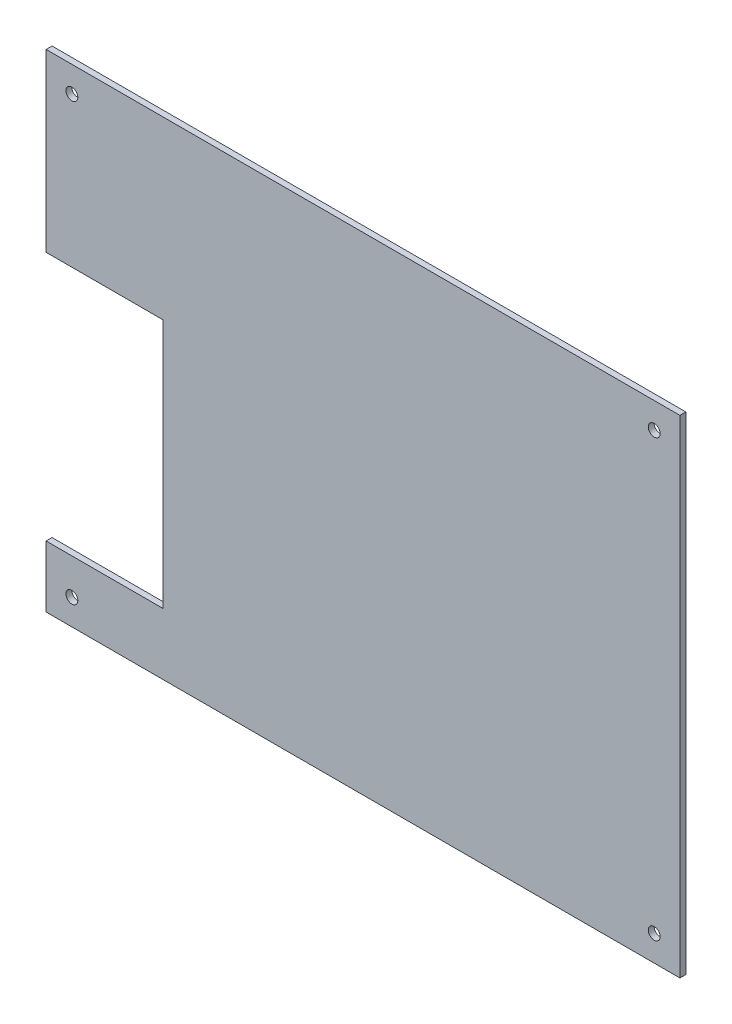
ISO-10303-21;
HEADER;
FILE_DESCRIPTION(('STEP AP214'),'2;1');
FILE_NAME('part.step','',(''),(''),'','','');
FILE_SCHEMA(('AUTOMOTIVE_DESIGN { 1 0 10303 214 1 1 1 1 }'));
ENDSEC;
DATA;
#1=APPLICATION_CONTEXT('core data for automotive mechanical design processes');
#2=APPLICATION_PROTOCOL_DEFINITION('international standard','automotive_design',2000,#1);
#3=PRODUCT_CONTEXT('',#1,'mechanical');
#4=PRODUCT('Part','Part','',(#3));
#5=PRODUCT_RELATED_PRODUCT_CATEGORY('part','',(#4));
#6=PRODUCT_DEFINITION_FORMATION('','',#4);
#7=PRODUCT_DEFINITION_CONTEXT('part definition',#1,'design');
#8=PRODUCT_DEFINITION('design','',#6,#7);
#9=PRODUCT_DEFINITION_SHAPE('','',#8);
#10=(LENGTH_UNIT() NAMED_UNIT(*) SI_UNIT(.MILLI.,.METRE.));
#11=(NAMED_UNIT(*) PLANE_ANGLE_UNIT() SI_UNIT($,.RADIAN.));
#12=(NAMED_UNIT(*) SI_UNIT($,.STERADIAN.) SOLID_ANGLE_UNIT());
#13=UNCERTAINTY_MEASURE_WITH_UNIT(LENGTH_MEASURE(1.E-05),#10,'distance_accuracy_value','');
#14=(GEOMETRIC_REPRESENTATION_CONTEXT(3) GLOBAL_UNCERTAINTY_ASSIGNED_CONTEXT((#13)) GLOBAL_UNIT_ASSIGNED_CONTEXT((#10,
#11,#12)) REPRESENTATION_CONTEXT('',''));
#15=CARTESIAN_POINT('',(0.,0.,0.));
#16=DIRECTION('',(0.,0.,1.));
#17=DIRECTION('',(1.,0.,0.));
#18=AXIS2_PLACEMENT_3D('',#15,#16,#17);
#19=CARTESIAN_POINT('',(1037.34751782577,-1519.02260067621,2.25));
#20=DIRECTION('',(0.,0.,1.));
#21=DIRECTION('',(1.,0.,0.));
#22=AXIS2_PLACEMENT_3D('',#19,#20,#21);
#23=PLANE('',#22);
#24=CARTESIAN_POINT('',(1079.10835313975,-1742.80288964024,2.25));
#25=DIRECTION('',(0.,0.,1.));
#26=DIRECTION('',(1.,0.,0.));
#27=AXIS2_PLACEMENT_3D('',#24,#25,#26);
#28=CIRCLE('',#27,1.49999999999995);
#29=CARTESIAN_POINT('',(1080.60835313975,-1742.80288964024,2.25));
#30=VERTEX_POINT('',#29);
#31=EDGE_CURVE('E120',#30,#30,#28,.T.);
#32=ORIENTED_EDGE('',*,*,#31,.F.);
#33=EDGE_LOOP('',(#32));
#34=FACE_BOUND('',#33,.T.);
#35=CARTESIAN_POINT('',(1079.10835313975,-1632.80288964024,2.25));
#36=DIRECTION('',(0.,0.,1.));
#37=DIRECTION('',(1.,0.,0.));
#38=AXIS2_PLACEMENT_3D('',#35,#36,#37);
#39=CIRCLE('',#38,1.49999999999995);
#40=CARTESIAN_POINT('',(1080.60835313975,-1632.80288964024,2.25));
#41=VERTEX_POINT('',#40);
#42=EDGE_CURVE('E115',#41,#41,#39,.T.);
#43=ORIENTED_EDGE('',*,*,#42,.F.);
#44=EDGE_LOOP('',(#43));
#45=FACE_BOUND('',#44,.T.);
#46=CARTESIAN_POINT('',(1226.10835313975,-1742.80288964024,2.25));
#47=DIRECTION('',(0.,0.,1.));
#48=DIRECTION('',(1.,0.,0.));
#49=AXIS2_PLACEMENT_3D('',#46,#47,#48);
#50=CIRCLE('',#49,1.49999999999995);
#51=CARTESIAN_POINT('',(1227.60835313975,-1742.80288964024,2.25));
#52=VERTEX_POINT('',#51);
#53=EDGE_CURVE('E116',#52,#52,#50,.T.);
#54=ORIENTED_EDGE('',*,*,#53,.F.);
#55=EDGE_LOOP('',(#54));
#56=FACE_BOUND('',#55,.T.);
#57=CARTESIAN_POINT('',(1226.10835313975,-1632.80288964024,2.25));
#58=DIRECTION('',(0.,0.,1.));
#59=DIRECTION('',(1.,0.,0.));
#60=AXIS2_PLACEMENT_3D('',#57,#58,#59);
#61=CIRCLE('',#60,1.49999999999995);
#62=CARTESIAN_POINT('',(1227.60835313975,-1632.80288964024,2.25));
#63=VERTEX_POINT('',#62);
#64=EDGE_CURVE('E124',#63,#63,#61,.T.);
#65=ORIENTED_EDGE('',*,*,#64,.F.);
#66=EDGE_LOOP('',(#65));
#67=FACE_BOUND('',#66,.T.);
#68=DIRECTION('',(0.,-1.,0.));
#69=VECTOR('',#68,1.);
#70=CARTESIAN_POINT('',(1072.60835313975,-1626.30288964024,2.25));
#71=LINE('',#70,#69);
#72=CARTESIAN_POINT('',(1072.60835313975,-1626.30288964024,2.25));
#73=VERTEX_POINT('',#72);
#74=CARTESIAN_POINT('',(1072.60835313975,-1670.66288964024,2.25));
#75=VERTEX_POINT('',#74);
#76=EDGE_CURVE('E151',#73,#75,#71,.T.);
#77=ORIENTED_EDGE('',*,*,#76,.T.);
#78=DIRECTION('',(1.,0.,0.));
#79=VECTOR('',#78,1.);
#80=CARTESIAN_POINT('',(1072.60835313975,-1670.66288964024,2.25));
#81=LINE('',#80,#79);
#82=CARTESIAN_POINT('',(1102.10835313975,-1670.66288964024,2.25));
#83=VERTEX_POINT('',#82);
#84=EDGE_CURVE('E173',#75,#83,#81,.T.);
#85=ORIENTED_EDGE('',*,*,#84,.T.);
#86=DIRECTION('',(0.,-1.,0.));
#87=VECTOR('',#86,1.);
#88=CARTESIAN_POINT('',(1102.10835313975,-1670.66288964024,2.25));
#89=LINE('',#88,#87);
#90=CARTESIAN_POINT('',(1102.10835313975,-1733.76288964024,2.25));
#91=VERTEX_POINT('',#90);
#92=EDGE_CURVE('E201',#83,#91,#89,.T.);
#93=ORIENTED_EDGE('',*,*,#92,.T.);
#94=DIRECTION('',(1.,0.,0.));
#95=VECTOR('',#94,1.);
#96=CARTESIAN_POINT('',(1072.60835313975,-1733.76288964024,2.25));
#97=LINE('',#96,#95);
#98=CARTESIAN_POINT('',(1072.60835313975,-1733.76288964024,2.25));
#99=VERTEX_POINT('',#98);
#100=EDGE_CURVE('E187',#99,#91,#97,.T.);
#101=ORIENTED_EDGE('',*,*,#100,.F.);
#102=CARTESIAN_POINT('',(1072.60835313975,-1749.30288964024,2.25));
#103=VERTEX_POINT('',#102);
#104=EDGE_CURVE('E108',#99,#103,#71,.T.);
#105=ORIENTED_EDGE('',*,*,#104,.T.);
#106=DIRECTION('',(1.,0.,0.));
#107=VECTOR('',#106,1.);
#108=CARTESIAN_POINT('',(1072.60835313975,-1749.30288964024,2.25));
#109=LINE('',#108,#107);
#110=CARTESIAN_POINT('',(1232.60835313975,-1749.30288964024,2.25));
#111=VERTEX_POINT('',#110);
#112=EDGE_CURVE('E153',#103,#111,#109,.T.);
#113=ORIENTED_EDGE('',*,*,#112,.T.);
#114=DIRECTION('',(0.,1.,0.));
#115=VECTOR('',#114,1.);
#116=CARTESIAN_POINT('',(1232.60835313975,-1626.30288964024,2.25));
#117=LINE('',#116,#115);
#118=CARTESIAN_POINT('',(1232.60835313975,-1626.30288964024,2.25));
#119=VERTEX_POINT('',#118);
#120=EDGE_CURVE('E101',#111,#119,#117,.T.);
#121=ORIENTED_EDGE('',*,*,#120,.T.);
#122=DIRECTION('',(-1.,0.,0.));
#123=VECTOR('',#122,1.);
#124=CARTESIAN_POINT('',(1072.60835313975,-1626.30288964024,2.25));
#125=LINE('',#124,#123);
#126=EDGE_CURVE('E64',#119,#73,#125,.T.);
#127=ORIENTED_EDGE('',*,*,#126,.T.);
#128=EDGE_LOOP('',(#77,#85,#93,#101,#105,#113,#121,#127));
#129=FACE_BOUND('',#128,.T.);
#130=ADVANCED_FACE('F38',(#34,#45,#56,#67,#129),#23,.T.);
#131=CARTESIAN_POINT('',(1037.34751782577,-1519.02260067621,0.75));
#132=DIRECTION('',(0.,0.,1.));
#133=DIRECTION('',(1.,0.,0.));
#134=AXIS2_PLACEMENT_3D('',#131,#132,#133);
#135=PLANE('',#134);
#136=CARTESIAN_POINT('',(1226.10835313975,-1632.80288964024,0.75));
#137=DIRECTION('',(0.,0.,1.));
#138=DIRECTION('',(1.,0.,0.));
#139=AXIS2_PLACEMENT_3D('',#136,#137,#138);
#140=CIRCLE('',#139,1.49999999999995);
#141=CARTESIAN_POINT('',(1227.60835313975,-1632.80288964024,0.75));
#142=VERTEX_POINT('',#141);
#143=EDGE_CURVE('E125',#142,#142,#140,.T.);
#144=ORIENTED_EDGE('',*,*,#143,.T.);
#145=EDGE_LOOP('',(#144));
#146=FACE_BOUND('',#145,.T.);
#147=CARTESIAN_POINT('',(1079.10835313975,-1742.80288964024,0.75));
#148=DIRECTION('',(0.,0.,1.));
#149=DIRECTION('',(1.,0.,0.));
#150=AXIS2_PLACEMENT_3D('',#147,#148,#149);
#151=CIRCLE('',#150,1.49999999999995);
#152=CARTESIAN_POINT('',(1080.60835313975,-1742.80288964024,0.75));
#153=VERTEX_POINT('',#152);
#154=EDGE_CURVE('E121',#153,#153,#151,.T.);
#155=ORIENTED_EDGE('',*,*,#154,.T.);
#156=EDGE_LOOP('',(#155));
#157=FACE_BOUND('',#156,.T.);
#158=CARTESIAN_POINT('',(1226.10835313975,-1742.80288964024,0.75));
#159=DIRECTION('',(0.,0.,1.));
#160=DIRECTION('',(1.,0.,0.));
#161=AXIS2_PLACEMENT_3D('',#158,#159,#160);
#162=CIRCLE('',#161,1.49999999999995);
#163=CARTESIAN_POINT('',(1227.60835313975,-1742.80288964024,0.75));
#164=VERTEX_POINT('',#163);
#165=EDGE_CURVE('E117',#164,#164,#162,.T.);
#166=ORIENTED_EDGE('',*,*,#165,.T.);
#167=EDGE_LOOP('',(#166));
#168=FACE_BOUND('',#167,.T.);
#169=CARTESIAN_POINT('',(1079.10835313975,-1632.80288964024,0.75));
#170=DIRECTION('',(0.,0.,1.));
#171=DIRECTION('',(1.,0.,0.));
#172=AXIS2_PLACEMENT_3D('',#169,#170,#171);
#173=CIRCLE('',#172,1.49999999999995);
#174=CARTESIAN_POINT('',(1080.60835313975,-1632.80288964024,0.75));
#175=VERTEX_POINT('',#174);
#176=EDGE_CURVE('E112',#175,#175,#173,.T.);
#177=ORIENTED_EDGE('',*,*,#176,.T.);
#178=EDGE_LOOP('',(#177));
#179=FACE_BOUND('',#178,.T.);
#180=DIRECTION('',(1.,0.,0.));
#181=VECTOR('',#180,1.);
#182=CARTESIAN_POINT('',(1072.60835313975,-1670.66288964024,0.75));
#183=LINE('',#182,#181);
#184=CARTESIAN_POINT('',(1072.60835313975,-1670.66288964024,0.75));
#185=VERTEX_POINT('',#184);
#186=CARTESIAN_POINT('',(1102.10835313975,-1670.66288964024,0.75));
#187=VERTEX_POINT('',#186);
#188=EDGE_CURVE('E196',#185,#187,#183,.T.);
#189=ORIENTED_EDGE('',*,*,#188,.F.);
#190=DIRECTION('',(0.,-1.,0.));
#191=VECTOR('',#190,1.);
#192=CARTESIAN_POINT('',(1072.60835313975,-1626.30288964024,0.75));
#193=LINE('',#192,#191);
#194=CARTESIAN_POINT('',(1072.60835313975,-1626.30288964024,0.75));
#195=VERTEX_POINT('',#194);
#196=EDGE_CURVE('E95',#195,#185,#193,.T.);
#197=ORIENTED_EDGE('',*,*,#196,.F.);
#198=DIRECTION('',(-1.,0.,0.));
#199=VECTOR('',#198,1.);
#200=CARTESIAN_POINT('',(1072.60835313975,-1626.30288964024,0.75));
#201=LINE('',#200,#199);
#202=CARTESIAN_POINT('',(1232.60835313975,-1626.30288964024,0.75));
#203=VERTEX_POINT('',#202);
#204=EDGE_CURVE('E106',#203,#195,#201,.T.);
#205=ORIENTED_EDGE('',*,*,#204,.F.);
#206=DIRECTION('',(0.,1.,0.));
#207=VECTOR('',#206,1.);
#208=CARTESIAN_POINT('',(1232.60835313975,-1626.30288964024,0.75));
#209=LINE('',#208,#207);
#210=CARTESIAN_POINT('',(1232.60835313975,-1749.30288964024,0.75));
#211=VERTEX_POINT('',#210);
#212=EDGE_CURVE('E94',#211,#203,#209,.T.);
#213=ORIENTED_EDGE('',*,*,#212,.F.);
#214=DIRECTION('',(1.,0.,0.));
#215=VECTOR('',#214,1.);
#216=CARTESIAN_POINT('',(1072.60835313975,-1749.30288964024,0.75));
#217=LINE('',#216,#215);
#218=CARTESIAN_POINT('',(1072.60835313975,-1749.30288964024,0.75));
#219=VERTEX_POINT('',#218);
#220=EDGE_CURVE('E85',#219,#211,#217,.T.);
#221=ORIENTED_EDGE('',*,*,#220,.F.);
#222=CARTESIAN_POINT('',(1072.60835313975,-1733.76288964024,0.75));
#223=VERTEX_POINT('',#222);
#224=EDGE_CURVE('E150',#223,#219,#193,.T.);
#225=ORIENTED_EDGE('',*,*,#224,.F.);
#226=DIRECTION('',(1.,0.,0.));
#227=VECTOR('',#226,1.);
#228=CARTESIAN_POINT('',(1072.60835313975,-1733.76288964024,0.75));
#229=LINE('',#228,#227);
#230=CARTESIAN_POINT('',(1102.10835313975,-1733.76288964024,0.75));
#231=VERTEX_POINT('',#230);
#232=EDGE_CURVE('E55',#223,#231,#229,.T.);
#233=ORIENTED_EDGE('',*,*,#232,.T.);
#234=DIRECTION('',(0.,-1.,0.));
#235=VECTOR('',#234,1.);
#236=CARTESIAN_POINT('',(1102.10835313975,-1670.66288964024,0.75));
#237=LINE('',#236,#235);
#238=EDGE_CURVE('E192',#187,#231,#237,.T.);
#239=ORIENTED_EDGE('',*,*,#238,.F.);
#240=EDGE_LOOP('',(#189,#197,#205,#213,#221,#225,#233,#239));
#241=FACE_BOUND('',#240,.T.);
#242=ADVANCED_FACE('F104',(#146,#157,#168,#179,#241),#135,.F.);
#243=CARTESIAN_POINT('',(1072.60835313975,-1626.30288964024,2.25));
#244=DIRECTION('',(1.,0.,0.));
#245=DIRECTION('',(0.,1.,0.));
#246=AXIS2_PLACEMENT_3D('',#243,#244,#245);
#247=PLANE('',#246);
#248=DIRECTION('',(0.,0.,1.));
#249=VECTOR('',#248,1.);
#250=CARTESIAN_POINT('',(1072.60835313975,-1670.66288964024,0.75));
#251=LINE('',#250,#249);
#252=EDGE_CURVE('E171',#185,#75,#251,.T.);
#253=ORIENTED_EDGE('',*,*,#252,.T.);
#254=ORIENTED_EDGE('',*,*,#76,.F.);
#255=DIRECTION('',(0.,0.,-1.));
#256=VECTOR('',#255,1.);
#257=CARTESIAN_POINT('',(1072.60835313975,-1626.30288964024,2.25));
#258=LINE('',#257,#256);
#259=EDGE_CURVE('E158',#73,#195,#258,.T.);
#260=ORIENTED_EDGE('',*,*,#259,.T.);
#261=ORIENTED_EDGE('',*,*,#196,.T.);
#262=EDGE_LOOP('',(#253,#254,#260,#261));
#263=FACE_BOUND('',#262,.T.);
#264=ADVANCED_FACE('F168',(#263),#247,.F.);
#265=ORIENTED_EDGE('',*,*,#104,.F.);
#266=DIRECTION('',(0.,0.,1.));
#267=VECTOR('',#266,1.);
#268=CARTESIAN_POINT('',(1072.60835313975,-1733.76288964024,0.75));
#269=LINE('',#268,#267);
#270=EDGE_CURVE('E142',#223,#99,#269,.T.);
#271=ORIENTED_EDGE('',*,*,#270,.F.);
#272=ORIENTED_EDGE('',*,*,#224,.T.);
#273=DIRECTION('',(0.,0.,-1.));
#274=VECTOR('',#273,1.);
#275=CARTESIAN_POINT('',(1072.60835313975,-1749.30288964024,2.25));
#276=LINE('',#275,#274);
#277=EDGE_CURVE('E11',#103,#219,#276,.T.);
#278=ORIENTED_EDGE('',*,*,#277,.F.);
#279=EDGE_LOOP('',(#265,#271,#272,#278));
#280=FACE_BOUND('',#279,.T.);
#281=ADVANCED_FACE('F189',(#280),#247,.F.);
#282=CARTESIAN_POINT('',(1072.60835313975,-1749.30288964024,2.25));
#283=DIRECTION('',(0.,1.,0.));
#284=DIRECTION('',(0.,0.,1.));
#285=AXIS2_PLACEMENT_3D('',#282,#283,#284);
#286=PLANE('',#285);
#287=ORIENTED_EDGE('',*,*,#220,.T.);
#288=DIRECTION('',(0.,0.,-1.));
#289=VECTOR('',#288,1.);
#290=CARTESIAN_POINT('',(1232.60835313975,-1749.30288964024,2.25));
#291=LINE('',#290,#289);
#292=EDGE_CURVE('E47',#111,#211,#291,.T.);
#293=ORIENTED_EDGE('',*,*,#292,.F.);
#294=ORIENTED_EDGE('',*,*,#112,.F.);
#295=ORIENTED_EDGE('',*,*,#277,.T.);
#296=EDGE_LOOP('',(#287,#293,#294,#295));
#297=FACE_BOUND('',#296,.T.);
#298=ADVANCED_FACE('F87',(#297),#286,.F.);
#299=CARTESIAN_POINT('',(1232.60835313975,-1626.30288964024,2.25));
#300=DIRECTION('',(-1.,0.,0.));
#301=DIRECTION('',(0.,0.,1.));
#302=AXIS2_PLACEMENT_3D('',#299,#300,#301);
#303=PLANE('',#302);
#304=ORIENTED_EDGE('',*,*,#212,.T.);
#305=DIRECTION('',(0.,0.,-1.));
#306=VECTOR('',#305,1.);
#307=CARTESIAN_POINT('',(1232.60835313975,-1626.30288964024,2.25));
#308=LINE('',#307,#306);
#309=EDGE_CURVE('E42',#119,#203,#308,.T.);
#310=ORIENTED_EDGE('',*,*,#309,.F.);
#311=ORIENTED_EDGE('',*,*,#120,.F.);
#312=ORIENTED_EDGE('',*,*,#292,.T.);
#313=EDGE_LOOP('',(#304,#310,#311,#312));
#314=FACE_BOUND('',#313,.T.);
#315=ADVANCED_FACE('F98',(#314),#303,.F.);
#316=CARTESIAN_POINT('',(1072.60835313975,-1626.30288964024,2.25));
#317=DIRECTION('',(0.,-1.,0.));
#318=DIRECTION('',(0.,0.,-1.));
#319=AXIS2_PLACEMENT_3D('',#316,#317,#318);
#320=PLANE('',#319);
#321=ORIENTED_EDGE('',*,*,#204,.T.);
#322=ORIENTED_EDGE('',*,*,#259,.F.);
#323=ORIENTED_EDGE('',*,*,#126,.F.);
#324=ORIENTED_EDGE('',*,*,#309,.T.);
#325=EDGE_LOOP('',(#321,#322,#323,#324));
#326=FACE_BOUND('',#325,.T.);
#327=ADVANCED_FACE('F166',(#326),#320,.F.);
#328=CARTESIAN_POINT('',(1079.10835313975,-1632.80288964024,2.25));
#329=DIRECTION('',(0.,0.,-1.));
#330=DIRECTION('',(-1.,0.,0.));
#331=AXIS2_PLACEMENT_3D('',#328,#329,#330);
#332=CYLINDRICAL_SURFACE('',#331,1.49999999999995);
#333=ORIENTED_EDGE('',*,*,#42,.T.);
#334=EDGE_LOOP('',(#333));
#335=FACE_BOUND('',#334,.T.);
#336=ORIENTED_EDGE('',*,*,#176,.F.);
#337=EDGE_LOOP('',(#336));
#338=FACE_BOUND('',#337,.T.);
#339=ADVANCED_FACE('F237',(#335,#338),#332,.F.);
#340=CARTESIAN_POINT('',(1226.10835313975,-1742.80288964024,2.25));
#341=DIRECTION('',(0.,0.,-1.));
#342=DIRECTION('',(-1.,0.,0.));
#343=AXIS2_PLACEMENT_3D('',#340,#341,#342);
#344=CYLINDRICAL_SURFACE('',#343,1.49999999999995);
#345=ORIENTED_EDGE('',*,*,#53,.T.);
#346=EDGE_LOOP('',(#345));
#347=FACE_BOUND('',#346,.T.);
#348=ORIENTED_EDGE('',*,*,#165,.F.);
#349=EDGE_LOOP('',(#348));
#350=FACE_BOUND('',#349,.T.);
#351=ADVANCED_FACE('F240',(#347,#350),#344,.F.);
#352=CARTESIAN_POINT('',(1079.10835313975,-1742.80288964024,2.25));
#353=DIRECTION('',(0.,0.,-1.));
#354=DIRECTION('',(-1.,0.,0.));
#355=AXIS2_PLACEMENT_3D('',#352,#353,#354);
#356=CYLINDRICAL_SURFACE('',#355,1.49999999999995);
#357=ORIENTED_EDGE('',*,*,#31,.T.);
#358=EDGE_LOOP('',(#357));
#359=FACE_BOUND('',#358,.T.);
#360=ORIENTED_EDGE('',*,*,#154,.F.);
#361=EDGE_LOOP('',(#360));
#362=FACE_BOUND('',#361,.T.);
#363=ADVANCED_FACE('F217',(#359,#362),#356,.F.);
#364=CARTESIAN_POINT('',(1226.10835313975,-1632.80288964024,2.25));
#365=DIRECTION('',(0.,0.,-1.));
#366=DIRECTION('',(-1.,0.,0.));
#367=AXIS2_PLACEMENT_3D('',#364,#365,#366);
#368=CYLINDRICAL_SURFACE('',#367,1.49999999999995);
#369=ORIENTED_EDGE('',*,*,#64,.T.);
#370=EDGE_LOOP('',(#369));
#371=FACE_BOUND('',#370,.T.);
#372=ORIENTED_EDGE('',*,*,#143,.F.);
#373=EDGE_LOOP('',(#372));
#374=FACE_BOUND('',#373,.T.);
#375=ADVANCED_FACE('F40',(#371,#374),#368,.F.);
#376=CARTESIAN_POINT('',(1072.60835313975,-1670.66288964024,0.75));
#377=DIRECTION('',(0.,-1.,0.));
#378=DIRECTION('',(0.,0.,-1.));
#379=AXIS2_PLACEMENT_3D('',#376,#377,#378);
#380=PLANE('',#379);
#381=ORIENTED_EDGE('',*,*,#84,.F.);
#382=ORIENTED_EDGE('',*,*,#252,.F.);
#383=ORIENTED_EDGE('',*,*,#188,.T.);
#384=DIRECTION('',(0.,0.,1.));
#385=VECTOR('',#384,1.);
#386=CARTESIAN_POINT('',(1102.10835313975,-1670.66288964024,0.75));
#387=LINE('',#386,#385);
#388=EDGE_CURVE('E127',#187,#83,#387,.T.);
#389=ORIENTED_EDGE('',*,*,#388,.T.);
#390=EDGE_LOOP('',(#381,#382,#383,#389));
#391=FACE_BOUND('',#390,.T.);
#392=ADVANCED_FACE('F209',(#391),#380,.T.);
#393=CARTESIAN_POINT('',(1102.10835313975,-1670.66288964024,0.75));
#394=DIRECTION('',(-1.,0.,0.));
#395=DIRECTION('',(0.,0.,1.));
#396=AXIS2_PLACEMENT_3D('',#393,#394,#395);
#397=PLANE('',#396);
#398=ORIENTED_EDGE('',*,*,#92,.F.);
#399=ORIENTED_EDGE('',*,*,#388,.F.);
#400=ORIENTED_EDGE('',*,*,#238,.T.);
#401=DIRECTION('',(0.,0.,1.));
#402=VECTOR('',#401,1.);
#403=CARTESIAN_POINT('',(1102.10835313975,-1733.76288964024,0.75));
#404=LINE('',#403,#402);
#405=EDGE_CURVE('E133',#231,#91,#404,.T.);
#406=ORIENTED_EDGE('',*,*,#405,.T.);
#407=EDGE_LOOP('',(#398,#399,#400,#406));
#408=FACE_BOUND('',#407,.T.);
#409=ADVANCED_FACE('F206',(#408),#397,.T.);
#410=CARTESIAN_POINT('',(1072.60835313975,-1733.76288964024,0.75));
#411=DIRECTION('',(0.,-1.,0.));
#412=DIRECTION('',(0.,0.,-1.));
#413=AXIS2_PLACEMENT_3D('',#410,#411,#412);
#414=PLANE('',#413);
#415=ORIENTED_EDGE('',*,*,#100,.T.);
#416=ORIENTED_EDGE('',*,*,#405,.F.);
#417=ORIENTED_EDGE('',*,*,#232,.F.);
#418=ORIENTED_EDGE('',*,*,#270,.T.);
#419=EDGE_LOOP('',(#415,#416,#417,#418));
#420=FACE_BOUND('',#419,.T.);
#421=ADVANCED_FACE('F203',(#420),#414,.F.);
#422=CLOSED_SHELL('',(#130,#242,#264,#281,#298,#315,#327,#339,#351,#363,#375,#392,#409,#421));
#423=MANIFOLD_SOLID_BREP('B2',#422);
#424=ADVANCED_BREP_SHAPE_REPRESENTATION('',(#18,#423),#14);
#425=SHAPE_DEFINITION_REPRESENTATION(#9,#424);
ENDSEC;
END-ISO-10303-21;
